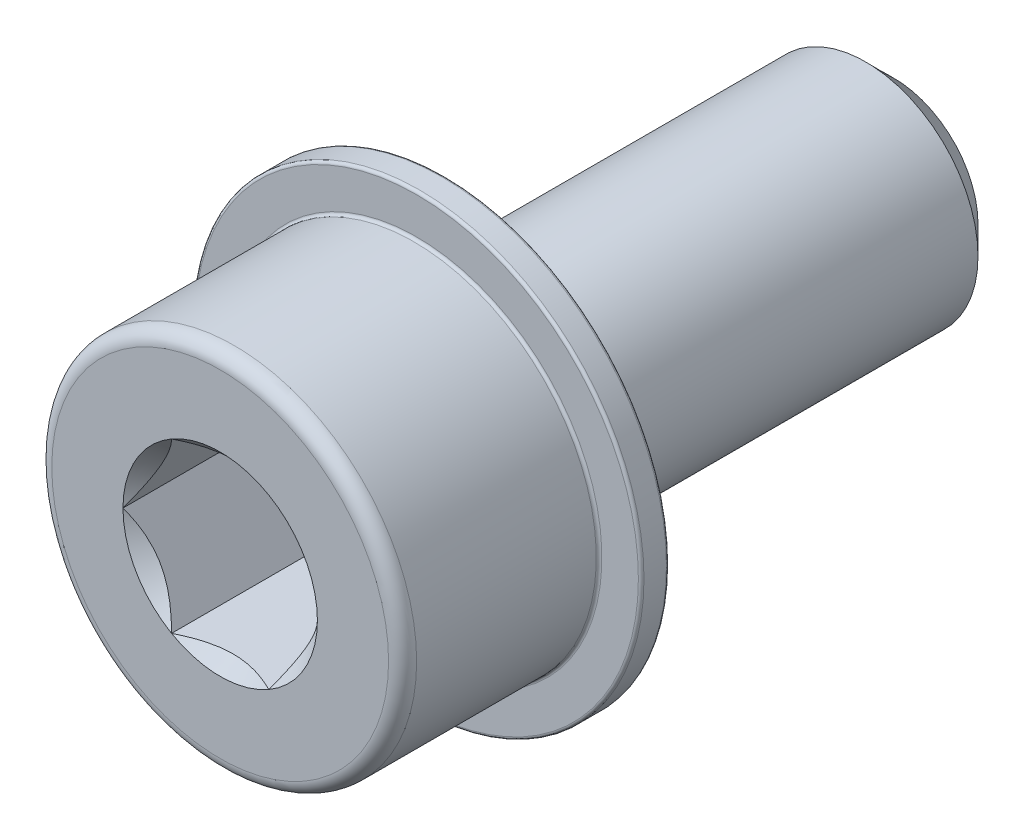
ISO-10303-21;
HEADER;
FILE_DESCRIPTION(('STEP AP214'),'2;1');
FILE_NAME('part.step','',(''),(''),'','','');
FILE_SCHEMA(('AUTOMOTIVE_DESIGN { 1 0 10303 214 1 1 1 1 }'));
ENDSEC;
DATA;
#1=APPLICATION_CONTEXT('core data for automotive mechanical design processes');
#2=APPLICATION_PROTOCOL_DEFINITION('international standard','automotive_design',2000,#1);
#3=PRODUCT_CONTEXT('',#1,'mechanical');
#4=PRODUCT('Part','Part','',(#3));
#5=PRODUCT_RELATED_PRODUCT_CATEGORY('part','',(#4));
#6=PRODUCT_DEFINITION_FORMATION('','',#4);
#7=PRODUCT_DEFINITION_CONTEXT('part definition',#1,'design');
#8=PRODUCT_DEFINITION('design','',#6,#7);
#9=PRODUCT_DEFINITION_SHAPE('','',#8);
#10=(LENGTH_UNIT() NAMED_UNIT(*) SI_UNIT(.MILLI.,.METRE.));
#11=(NAMED_UNIT(*) PLANE_ANGLE_UNIT() SI_UNIT($,.RADIAN.));
#12=(NAMED_UNIT(*) SI_UNIT($,.STERADIAN.) SOLID_ANGLE_UNIT());
#13=UNCERTAINTY_MEASURE_WITH_UNIT(LENGTH_MEASURE(1.E-05),#10,'distance_accuracy_value','');
#14=(GEOMETRIC_REPRESENTATION_CONTEXT(3) GLOBAL_UNCERTAINTY_ASSIGNED_CONTEXT((#13)) GLOBAL_UNIT_ASSIGNED_CONTEXT((#10,
#11,#12)) REPRESENTATION_CONTEXT('',''));
#15=CARTESIAN_POINT('',(0.,0.,0.));
#16=DIRECTION('',(0.,0.,1.));
#17=DIRECTION('',(1.,0.,0.));
#18=AXIS2_PLACEMENT_3D('',#15,#16,#17);
#19=CARTESIAN_POINT('',(0.,0.,24.));
#20=DIRECTION('',(0.,0.,-1.));
#21=DIRECTION('',(-1.,0.,0.));
#22=AXIS2_PLACEMENT_3D('',#19,#20,#21);
#23=CYLINDRICAL_SURFACE('',#22,6.5);
#24=CARTESIAN_POINT('',(0.,0.,17.1));
#25=DIRECTION('',(0.,0.,-1.));
#26=DIRECTION('',(-1.,0.,0.));
#27=AXIS2_PLACEMENT_3D('',#24,#25,#26);
#28=CIRCLE('',#27,6.5);
#29=CARTESIAN_POINT('',(-6.5,0.,17.1));
#30=VERTEX_POINT('',#29);
#31=EDGE_CURVE('E11',#30,#30,#28,.F.);
#32=ORIENTED_EDGE('',*,*,#31,.T.);
#33=EDGE_LOOP('',(#32));
#34=FACE_BOUND('',#33,.T.);
#35=CARTESIAN_POINT('',(0.,0.,23.5));
#36=DIRECTION('',(0.,0.,1.));
#37=DIRECTION('',(1.,0.,0.));
#38=AXIS2_PLACEMENT_3D('',#35,#36,#37);
#39=CIRCLE('',#38,6.5);
#40=CARTESIAN_POINT('',(6.5,0.,23.5));
#41=VERTEX_POINT('',#40);
#42=EDGE_CURVE('E258',#41,#41,#39,.F.);
#43=ORIENTED_EDGE('',*,*,#42,.T.);
#44=EDGE_LOOP('',(#43));
#45=FACE_BOUND('',#44,.T.);
#46=ADVANCED_FACE('F36',(#34,#45),#23,.T.);
#47=CARTESIAN_POINT('',(0.,0.,24.));
#48=DIRECTION('',(0.,0.,1.));
#49=DIRECTION('',(1.,0.,0.));
#50=AXIS2_PLACEMENT_3D('',#47,#48,#49);
#51=PLANE('',#50);
#52=CARTESIAN_POINT('',(0.,0.,24.));
#53=DIRECTION('',(0.,0.,1.));
#54=DIRECTION('',(1.,0.,0.));
#55=AXIS2_PLACEMENT_3D('',#52,#53,#54);
#56=CIRCLE('',#55,6.);
#57=CARTESIAN_POINT('',(6.,0.,24.));
#58=VERTEX_POINT('',#57);
#59=EDGE_CURVE('E109',#58,#58,#56,.T.);
#60=ORIENTED_EDGE('',*,*,#59,.T.);
#61=EDGE_LOOP('',(#60));
#62=FACE_BOUND('',#61,.T.);
#63=CARTESIAN_POINT('',(0.,0.,24.));
#64=DIRECTION('',(0.,0.,1.));
#65=DIRECTION('',(1.,0.,0.));
#66=AXIS2_PLACEMENT_3D('',#63,#64,#65);
#67=CIRCLE('',#66,3.46410161513776);
#68=CARTESIAN_POINT('',(3.46410161513776,0.,24.));
#69=VERTEX_POINT('',#68);
#70=CARTESIAN_POINT('',(1.73205080756888,3.,24.));
#71=VERTEX_POINT('',#70);
#72=EDGE_CURVE('E90',#69,#71,#67,.T.);
#73=ORIENTED_EDGE('',*,*,#72,.F.);
#74=CARTESIAN_POINT('',(1.73205080756888,-3.,24.));
#75=VERTEX_POINT('',#74);
#76=EDGE_CURVE('E50',#75,#69,#67,.T.);
#77=ORIENTED_EDGE('',*,*,#76,.F.);
#78=CARTESIAN_POINT('',(-1.73205080756888,-3.,24.));
#79=VERTEX_POINT('',#78);
#80=EDGE_CURVE('E320',#79,#75,#67,.T.);
#81=ORIENTED_EDGE('',*,*,#80,.F.);
#82=CARTESIAN_POINT('',(-3.46410161513776,0.,24.));
#83=VERTEX_POINT('',#82);
#84=EDGE_CURVE('E57',#83,#79,#67,.T.);
#85=ORIENTED_EDGE('',*,*,#84,.F.);
#86=CARTESIAN_POINT('',(-1.73205080756888,3.,24.));
#87=VERTEX_POINT('',#86);
#88=EDGE_CURVE('E131',#87,#83,#67,.T.);
#89=ORIENTED_EDGE('',*,*,#88,.F.);
#90=EDGE_CURVE('E99',#71,#87,#67,.T.);
#91=ORIENTED_EDGE('',*,*,#90,.F.);
#92=EDGE_LOOP('',(#73,#77,#81,#85,#89,#91));
#93=FACE_BOUND('',#92,.T.);
#94=ADVANCED_FACE('F130',(#62,#93),#51,.T.);
#95=CARTESIAN_POINT('',(0.,0.,24.));
#96=DIRECTION('',(0.,0.,1.));
#97=DIRECTION('',(1.,0.,0.));
#98=AXIS2_PLACEMENT_3D('',#95,#96,#97);
#99=CONICAL_SURFACE('',#98,3.46410161513776,0.785398163397449);
#100=ORIENTED_EDGE('',*,*,#90,.T.);
#101=CARTESIAN_POINT('',(-3.40188153141397,3.,25.071623018675));
#102=CARTESIAN_POINT('',(-3.31880839496225,3.,25.0093307707653));
#103=CARTESIAN_POINT('',(-3.23526432463499,3.,24.9476562262713));
#104=CARTESIAN_POINT('',(-3.06705083944725,3.,24.825817186681));
#105=CARTESIAN_POINT('',(-2.98238114192822,3.,24.7656530822642));
#106=CARTESIAN_POINT('',(-2.81111390830011,3.,24.6466823260063));
#107=CARTESIAN_POINT('',(-2.72450651479474,3.,24.5878898159252));
#108=CARTESIAN_POINT('',(-2.5498128465526,3.,24.4725516902232));
#109=CARTESIAN_POINT('',(-2.46172667795769,3.,24.4160059143113));
#110=CARTESIAN_POINT('',(-2.27892768432208,3.,24.3026064434241));
#111=CARTESIAN_POINT('',(-2.18411772294209,3.,24.2459085325007));
#112=CARTESIAN_POINT('',(-1.99231796342786,3.,24.1363338489189));
#113=CARTESIAN_POINT('',(-1.89532845598629,3.,24.0834565706102));
#114=CARTESIAN_POINT('',(-1.6991502417869,3.,23.9826433846406));
#115=CARTESIAN_POINT('',(-1.59996871640864,3.,23.9346936118117));
#116=CARTESIAN_POINT('',(-1.39893527870468,3.,23.8448170133997));
#117=CARTESIAN_POINT('',(-1.29708458210817,3.,23.8028875002659));
#118=CARTESIAN_POINT('',(-1.0982186531427,3.,23.7293601977538));
#119=CARTESIAN_POINT('',(-1.00140329048655,3.,23.6972274830937));
#120=CARTESIAN_POINT('',(-0.805487586800686,3.,23.6407367466802));
#121=CARTESIAN_POINT('',(-0.706387084473375,3.,23.6163792755582));
#122=CARTESIAN_POINT('',(-0.508116211624926,3.,23.5771014895869));
#123=CARTESIAN_POINT('',(-0.408977763183684,3.,23.5620226377466));
#124=CARTESIAN_POINT('',(-0.209698791301063,3.,23.5415865192691));
#125=CARTESIAN_POINT('',(-0.109558431989066,3.,23.5362276857281));
#126=CARTESIAN_POINT('',(0.0873520516843387,3.,23.535609235846));
#127=CARTESIAN_POINT('',(0.184121252918254,3.,23.5400131533177));
#128=CARTESIAN_POINT('',(0.376804854524576,3.,23.557946416793));
#129=CARTESIAN_POINT('',(0.472719169351943,3.,23.5714766658715));
#130=CARTESIAN_POINT('',(0.66461966332242,3.,23.6071635369876));
#131=CARTESIAN_POINT('',(0.760578448954833,3.,23.6294651712297));
#132=CARTESIAN_POINT('',(0.950411386335508,3.,23.6815211461887));
#133=CARTESIAN_POINT('',(1.04428572934496,3.,23.7112748000321));
#134=CARTESIAN_POINT('',(1.23968230612517,3.,23.7805237867733));
#135=CARTESIAN_POINT('',(1.34095401081408,3.,23.8207192131534));
#136=CARTESIAN_POINT('',(1.54084264319093,3.,23.9072590407946));
#137=CARTESIAN_POINT('',(1.63945865301323,3.,23.9536055360041));
#138=CARTESIAN_POINT('',(1.8345457021536,3.,24.0513511324151));
#139=CARTESIAN_POINT('',(1.93100848905254,3.,24.1027665721575));
#140=CARTESIAN_POINT('',(2.12170828880386,3.,24.2095076183011));
#141=CARTESIAN_POINT('',(2.21594570238894,3.,24.2648325134343));
#142=CARTESIAN_POINT('',(2.39783630702513,3.,24.3757799204079));
#143=CARTESIAN_POINT('',(2.48558325753569,3.,24.4312495308021));
#144=CARTESIAN_POINT('',(2.65957133871347,3.,24.5445092718899));
#145=CARTESIAN_POINT('',(2.74581235420106,3.,24.6022995789736));
#146=CARTESIAN_POINT('',(2.91628413803161,3.,24.7193054641893));
#147=CARTESIAN_POINT('',(3.00052556721126,3.,24.7785055655618));
#148=CARTESIAN_POINT('',(3.16785911169907,3.,24.8984622960702));
#149=CARTESIAN_POINT('',(3.25095153629611,3.,24.9592184932626));
#150=CARTESIAN_POINT('',(3.33356317170769,3.,25.0206105740407));
#151=B_SPLINE_CURVE_WITH_KNOTS('',3,(#101,#102,#103,#104,#105,#106,#107,#108,#109,#110,#111,
#112,#113,#114,#115,#116,#117,#118,#119,#120,#121,#122,#123,#124,#125,#126,#127,#128,#129,#130,
#131,#132,#133,#134,#135,#136,#137,#138,#139,#140,#141,#142,#143,#144,#145,#146,#147,#148,#149,
#150),.UNSPECIFIED.,.F.,.F.,(4,2,2,2,2,2,2,2,2,2,2,2,2,2,2,2,2,2,2,2,2,2,2,2,4),(0.,
0.31150788964413,0.623095538398644,0.937099065704867,1.25108015037407,1.58241857439006,
1.91371306604159,2.24404824101607,2.57423548692227,2.87999017792551,3.18576651722764,
3.486161620239,3.78650829411698,4.07666515932723,4.36685074054528,4.6620503227987,
4.95722270569223,5.28383771583299,5.61056419890145,5.93838056110907,6.26613743475899,
6.57752286720456,6.88893201218749,7.19780024979462,7.50658366111556),.UNSPECIFIED.);
#152=EDGE_CURVE('E104',#71,#87,#151,.F.);
#153=ORIENTED_EDGE('',*,*,#152,.F.);
#154=EDGE_LOOP('',(#100,#153));
#155=FACE_BOUND('',#154,.T.);
#156=ADVANCED_FACE('F105',(#155),#99,.F.);
#157=ORIENTED_EDGE('',*,*,#88,.T.);
#158=CARTESIAN_POINT('',(-1.73193533751504,3.0002,24.0001154758271));
#159=CARTESIAN_POINT('',(-1.79147372663452,2.89707648504425,23.9406283183218));
#160=CARTESIAN_POINT('',(-1.85200767512883,2.79222861066935,23.8846349794655));
#161=CARTESIAN_POINT('',(-1.97544301635334,2.5784323282189,23.7821125963789));
#162=CARTESIAN_POINT('',(-2.03835614749388,2.46946358862024,23.7356405937413));
#163=CARTESIAN_POINT('',(-2.16521745390422,2.24973336040297,23.6560331885163));
#164=CARTESIAN_POINT('',(-2.22913332270057,2.13902782823779,23.6226977006427));
#165=CARTESIAN_POINT('',(-2.35837216363117,1.91517958943467,23.5713375439793));
#166=CARTESIAN_POINT('',(-2.42369118784644,1.802043720793,23.5532745375356));
#167=CARTESIAN_POINT('',(-2.53626564359199,1.60705904380729,23.5369769084505));
#168=CARTESIAN_POINT('',(-2.58337569224233,1.52546204599786,23.5345643671738));
#169=CARTESIAN_POINT('',(-2.67751916315865,1.36240077116991,23.5386294346571));
#170=CARTESIAN_POINT('',(-2.7245525527757,1.28093655070101,23.5451101600283));
#171=CARTESIAN_POINT('',(-2.81817374583237,1.11877988766163,23.5665917225152));
#172=CARTESIAN_POINT('',(-2.86476099147974,1.03808841121569,23.5816020899673));
#173=CARTESIAN_POINT('',(-2.95713536549225,0.878091302108662,23.619323646066));
#174=CARTESIAN_POINT('',(-3.00292255491614,0.798785563690701,23.6420342443228));
#175=CARTESIAN_POINT('',(-3.0842086834051,0.657993859197245,23.6887606848539));
#176=CARTESIAN_POINT('',(-3.11988753362891,0.596196277853973,23.7115483276808));
#177=CARTESIAN_POINT('',(-3.19060468282508,0.473710582479779,23.7607962860574));
#178=CARTESIAN_POINT('',(-3.2256429622163,0.413022502364395,23.7872567136662));
#179=CARTESIAN_POINT('',(-3.29496858432308,0.292947002609136,23.8432569943914));
#180=CARTESIAN_POINT('',(-3.32925789884291,0.233556167704082,23.8727871644784));
#181=CARTESIAN_POINT('',(-3.39720147685868,0.115874438532731,23.9345390915755));
#182=CARTESIAN_POINT('',(-3.43085611477446,0.0575828957522661,23.9667591966594));
#183=CARTESIAN_POINT('',(-3.46421708519159,-0.000200000000000237,24.0001154758271));
#184=B_SPLINE_CURVE_WITH_KNOTS('',3,(#158,#159,#160,#161,#162,#163,#164,#165,#166,#167,#168,
#169,#170,#171,#172,#173,#174,#175,#176,#177,#178,#179,#180,#181,#182,#183),.UNSPECIFIED.,.F.,
.F.,(4,2,2,2,2,2,2,2,2,2,2,2,4),(0.,0.399603557139308,0.801535286397847,1.19708369162343,
1.59163620080173,1.87398941755845,2.15644160919093,2.43921001247426,2.72195674032138,
2.94657516661927,3.17120044767274,3.3951375283781,3.61893808380739),.UNSPECIFIED.);
#185=EDGE_CURVE('E98',#87,#83,#184,.T.);
#186=ORIENTED_EDGE('',*,*,#185,.F.);
#187=EDGE_LOOP('',(#157,#186));
#188=FACE_BOUND('',#187,.T.);
#189=ADVANCED_FACE('F326',(#188),#99,.F.);
#190=ORIENTED_EDGE('',*,*,#84,.T.);
#191=CARTESIAN_POINT('',(-3.46421708519159,0.000199999999999766,24.0001154758271));
#192=CARTESIAN_POINT('',(-3.40467869607211,-0.102923514955749,23.9406283183218));
#193=CARTESIAN_POINT('',(-3.3441447475778,-0.207771389330651,23.8846349794655));
#194=CARTESIAN_POINT('',(-3.22070940635329,-0.421567671781097,23.7821125963789));
#195=CARTESIAN_POINT('',(-3.15779627521275,-0.53053641137976,23.7356405937413));
#196=CARTESIAN_POINT('',(-3.03093496880241,-0.750266639597028,23.6560331885163));
#197=CARTESIAN_POINT('',(-2.96701910000606,-0.860972171762211,23.6226977006427));
#198=CARTESIAN_POINT('',(-2.83778025907546,-1.08482041056532,23.5713375439793));
#199=CARTESIAN_POINT('',(-2.77246123486019,-1.19795627920699,23.5532745375356));
#200=CARTESIAN_POINT('',(-2.65988677911464,-1.3929409561927,23.5369769084505));
#201=CARTESIAN_POINT('',(-2.6127767304643,-1.47453795400213,23.5345643671738));
#202=CARTESIAN_POINT('',(-2.51863325954798,-1.63759922883009,23.5386294346571));
#203=CARTESIAN_POINT('',(-2.47159986993094,-1.71906344929899,23.5451101600283));
#204=CARTESIAN_POINT('',(-2.37797867687426,-1.88122011233837,23.5665917225152));
#205=CARTESIAN_POINT('',(-2.33139143122689,-1.9619115887843,23.5816020899673));
#206=CARTESIAN_POINT('',(-2.23901705721438,-2.12190869789133,23.619323646066));
#207=CARTESIAN_POINT('',(-2.19322986779049,-2.20121443630929,23.6420342443228));
#208=CARTESIAN_POINT('',(-2.11194373930153,-2.34200614080275,23.6887606848539));
#209=CARTESIAN_POINT('',(-2.07626488907772,-2.40380372214602,23.7115483276808));
#210=CARTESIAN_POINT('',(-2.00554773988155,-2.52628941752022,23.7607962860574));
#211=CARTESIAN_POINT('',(-1.97050946049033,-2.5869774976356,23.7872567136662));
#212=CARTESIAN_POINT('',(-1.90118383838356,-2.70705299739086,23.8432569943914));
#213=CARTESIAN_POINT('',(-1.86689452386373,-2.76644383229592,23.8727871644784));
#214=CARTESIAN_POINT('',(-1.79895094584795,-2.88412556146727,23.9345390915755));
#215=CARTESIAN_POINT('',(-1.76529630793216,-2.94241710424773,23.9667591966594));
#216=CARTESIAN_POINT('',(-1.73193533751504,-3.0002,24.0001154758271));
#217=B_SPLINE_CURVE_WITH_KNOTS('',3,(#191,#192,#193,#194,#195,#196,#197,#198,#199,#200,#201,
#202,#203,#204,#205,#206,#207,#208,#209,#210,#211,#212,#213,#214,#215,#216),.UNSPECIFIED.,.F.,
.F.,(4,2,2,2,2,2,2,2,2,2,2,2,4),(0.,0.399603557139307,0.801535286397845,1.19708369162343,
1.59163620080173,1.87398941755844,2.15644160919092,2.43921001247425,2.72195674032138,
2.94657516661926,3.17120044767274,3.3951375283781,3.61893808380739),.UNSPECIFIED.);
#218=EDGE_CURVE('E141',#83,#79,#217,.T.);
#219=ORIENTED_EDGE('',*,*,#218,.F.);
#220=EDGE_LOOP('',(#190,#219));
#221=FACE_BOUND('',#220,.T.);
#222=ADVANCED_FACE('F328',(#221),#99,.F.);
#223=ORIENTED_EDGE('',*,*,#80,.T.);
#224=CARTESIAN_POINT('',(-3.40188153141397,-3.,25.071623018675));
#225=CARTESIAN_POINT('',(-3.31880839496224,-3.,25.0093307707653));
#226=CARTESIAN_POINT('',(-3.23526432463498,-3.,24.9476562262713));
#227=CARTESIAN_POINT('',(-3.06705083944724,-3.,24.825817186681));
#228=CARTESIAN_POINT('',(-2.98238114192821,-3.,24.7656530822642));
#229=CARTESIAN_POINT('',(-2.81111390830011,-3.,24.6466823260063));
#230=CARTESIAN_POINT('',(-2.72450651479473,-3.,24.5878898159252));
#231=CARTESIAN_POINT('',(-2.54981284655259,-3.,24.4725516902232));
#232=CARTESIAN_POINT('',(-2.46172667795768,-3.,24.4160059143113));
#233=CARTESIAN_POINT('',(-2.27892768432207,-3.,24.3026064434241));
#234=CARTESIAN_POINT('',(-2.18411772294209,-3.,24.2459085325007));
#235=CARTESIAN_POINT('',(-1.99231796342786,-3.,24.1363338489189));
#236=CARTESIAN_POINT('',(-1.89532845598629,-3.,24.0834565706102));
#237=CARTESIAN_POINT('',(-1.69915024178689,-3.,23.9826433846406));
#238=CARTESIAN_POINT('',(-1.59996871640864,-3.,23.9346936118117));
#239=CARTESIAN_POINT('',(-1.39893527870468,-3.,23.8448170133997));
#240=CARTESIAN_POINT('',(-1.29708458210817,-3.,23.8028875002659));
#241=CARTESIAN_POINT('',(-1.0982186531427,-3.,23.7293601977538));
#242=CARTESIAN_POINT('',(-1.00140329048654,-3.,23.6972274830937));
#243=CARTESIAN_POINT('',(-0.805487586800684,-3.,23.6407367466802));
#244=CARTESIAN_POINT('',(-0.706387084473374,-3.,23.6163792755582));
#245=CARTESIAN_POINT('',(-0.508116211624925,-3.,23.5771014895869));
#246=CARTESIAN_POINT('',(-0.408977763183682,-3.,23.5620226377466));
#247=CARTESIAN_POINT('',(-0.20969879130106,-3.,23.5415865192691));
#248=CARTESIAN_POINT('',(-0.109558431989063,-3.,23.5362276857281));
#249=CARTESIAN_POINT('',(0.0873520516843421,-3.,23.535609235846));
#250=CARTESIAN_POINT('',(0.184121252918257,-3.,23.5400131533177));
#251=CARTESIAN_POINT('',(0.376804854524579,-3.,23.557946416793));
#252=CARTESIAN_POINT('',(0.472719169351945,-3.,23.5714766658715));
#253=CARTESIAN_POINT('',(0.664619663322421,-3.,23.6071635369876));
#254=CARTESIAN_POINT('',(0.760578448954833,-3.,23.6294651712297));
#255=CARTESIAN_POINT('',(0.950411386335509,-3.,23.6815211461887));
#256=CARTESIAN_POINT('',(1.04428572934496,-3.,23.7112748000321));
#257=CARTESIAN_POINT('',(1.23968230612517,-3.,23.7805237867733));
#258=CARTESIAN_POINT('',(1.34095401081408,-3.,23.8207192131534));
#259=CARTESIAN_POINT('',(1.54084264319093,-3.,23.9072590407946));
#260=CARTESIAN_POINT('',(1.63945865301323,-3.,23.9536055360041));
#261=CARTESIAN_POINT('',(1.8345457021536,-3.,24.0513511324151));
#262=CARTESIAN_POINT('',(1.93100848905254,-3.,24.1027665721575));
#263=CARTESIAN_POINT('',(2.12170828880386,-3.,24.2095076183011));
#264=CARTESIAN_POINT('',(2.21594570238895,-3.,24.2648325134343));
#265=CARTESIAN_POINT('',(2.39783630702514,-3.,24.3757799204079));
#266=CARTESIAN_POINT('',(2.48558325753569,-3.,24.4312495308021));
#267=CARTESIAN_POINT('',(2.65957133871347,-3.,24.5445092718899));
#268=CARTESIAN_POINT('',(2.74581235420107,-3.,24.6022995789736));
#269=CARTESIAN_POINT('',(2.91628413803161,-3.,24.7193054641893));
#270=CARTESIAN_POINT('',(3.00052556721127,-3.,24.7785055655618));
#271=CARTESIAN_POINT('',(3.16785911169908,-3.,24.8984622960703));
#272=CARTESIAN_POINT('',(3.25095153629611,-3.,24.9592184932626));
#273=CARTESIAN_POINT('',(3.3335631717077,-3.,25.0206105740407));
#274=B_SPLINE_CURVE_WITH_KNOTS('',3,(#224,#225,#226,#227,#228,#229,#230,#231,#232,#233,#234,
#235,#236,#237,#238,#239,#240,#241,#242,#243,#244,#245,#246,#247,#248,#249,#250,#251,#252,#253,
#254,#255,#256,#257,#258,#259,#260,#261,#262,#263,#264,#265,#266,#267,#268,#269,#270,#271,#272,
#273),.UNSPECIFIED.,.F.,.F.,(4,2,2,2,2,2,2,2,2,2,2,2,2,2,2,2,2,2,2,2,2,2,2,2,4),(0.,
0.311507889644128,0.623095538398643,0.937099065704863,1.25108015037407,1.58241857439006,
1.91371306604158,2.24404824101606,2.57423548692226,2.8799901779255,3.18576651722763,
3.486161620239,3.78650829411697,4.07666515932722,4.36685074054527,4.66205032279869,
4.95722270569223,5.28383771583299,5.61056419890145,5.93838056110906,6.26613743475899,
6.57752286720455,6.88893201218749,7.19780024979462,7.50658366111556),.UNSPECIFIED.);
#275=EDGE_CURVE('E171',#79,#75,#274,.T.);
#276=ORIENTED_EDGE('',*,*,#275,.F.);
#277=EDGE_LOOP('',(#223,#276));
#278=FACE_BOUND('',#277,.T.);
#279=ADVANCED_FACE('F321',(#278),#99,.F.);
#280=ORIENTED_EDGE('',*,*,#76,.T.);
#281=CARTESIAN_POINT('',(1.73193533751504,-3.0002,24.0001154758272));
#282=CARTESIAN_POINT('',(1.79147372663452,-2.89707648504425,23.9406283183218));
#283=CARTESIAN_POINT('',(1.85200767512883,-2.79222861066935,23.8846349794655));
#284=CARTESIAN_POINT('',(1.97544301635334,-2.57843232821891,23.7821125963789));
#285=CARTESIAN_POINT('',(2.03835614749388,-2.46946358862024,23.7356405937413));
#286=CARTESIAN_POINT('',(2.16521745390422,-2.24973336040297,23.6560331885163));
#287=CARTESIAN_POINT('',(2.22913332270057,-2.13902782823779,23.6226977006427));
#288=CARTESIAN_POINT('',(2.35837216363117,-1.91517958943468,23.5713375439793));
#289=CARTESIAN_POINT('',(2.42369118784644,-1.80204372079301,23.5532745375356));
#290=CARTESIAN_POINT('',(2.53626564359199,-1.6070590438073,23.5369769084505));
#291=CARTESIAN_POINT('',(2.58337569224233,-1.52546204599787,23.5345643671738));
#292=CARTESIAN_POINT('',(2.67751916315865,-1.36240077116991,23.5386294346571));
#293=CARTESIAN_POINT('',(2.7245525527757,-1.28093655070101,23.5451101600283));
#294=CARTESIAN_POINT('',(2.81817374583237,-1.11877988766163,23.5665917225152));
#295=CARTESIAN_POINT('',(2.86476099147974,-1.0380884112157,23.5816020899673));
#296=CARTESIAN_POINT('',(2.95713536549225,-0.878091302108666,23.619323646066));
#297=CARTESIAN_POINT('',(3.00292255491614,-0.798785563690705,23.6420342443228));
#298=CARTESIAN_POINT('',(3.0842086834051,-0.657993859197248,23.6887606848539));
#299=CARTESIAN_POINT('',(3.11988753362891,-0.596196277853976,23.7115483276808));
#300=CARTESIAN_POINT('',(3.19060468282508,-0.473710582479783,23.7607962860574));
#301=CARTESIAN_POINT('',(3.2256429622163,-0.413022502364399,23.7872567136662));
#302=CARTESIAN_POINT('',(3.29496858432308,-0.292947002609139,23.8432569943914));
#303=CARTESIAN_POINT('',(3.32925789884291,-0.233556167704083,23.8727871644784));
#304=CARTESIAN_POINT('',(3.39720147685869,-0.115874438532732,23.9345390915755));
#305=CARTESIAN_POINT('',(3.43085611477447,-0.0575828957522665,23.9667591966594));
#306=CARTESIAN_POINT('',(3.46421708519159,0.000199999999999132,24.0001154758271));
#307=B_SPLINE_CURVE_WITH_KNOTS('',3,(#281,#282,#283,#284,#285,#286,#287,#288,#289,#290,#291,
#292,#293,#294,#295,#296,#297,#298,#299,#300,#301,#302,#303,#304,#305,#306),.UNSPECIFIED.,.F.,
.F.,(4,2,2,2,2,2,2,2,2,2,2,2,4),(0.,0.399603557139308,0.801535286397848,1.19708369162343,
1.59163620080173,1.87398941755845,2.15644160919093,2.43921001247425,2.72195674032138,
2.94657516661927,3.17120044767274,3.3951375283781,3.61893808380739),.UNSPECIFIED.);
#308=EDGE_CURVE('E120',#75,#69,#307,.T.);
#309=ORIENTED_EDGE('',*,*,#308,.F.);
#310=EDGE_LOOP('',(#280,#309));
#311=FACE_BOUND('',#310,.T.);
#312=ADVANCED_FACE('F156',(#311),#99,.F.);
#313=ORIENTED_EDGE('',*,*,#72,.T.);
#314=CARTESIAN_POINT('',(3.46421708519159,-0.000199999999999999,24.0001154758272));
#315=CARTESIAN_POINT('',(3.40467869607211,0.102923514955748,23.9406283183218));
#316=CARTESIAN_POINT('',(3.3441447475778,0.20777138933065,23.8846349794655));
#317=CARTESIAN_POINT('',(3.2207094063533,0.421567671781096,23.7821125963789));
#318=CARTESIAN_POINT('',(3.15779627521275,0.530536411379761,23.7356405937413));
#319=CARTESIAN_POINT('',(3.03093496880241,0.75026663959703,23.6560331885163));
#320=CARTESIAN_POINT('',(2.96701910000607,0.860972171762214,23.6226977006427));
#321=CARTESIAN_POINT('',(2.83778025907546,1.08482041056533,23.5713375439793));
#322=CARTESIAN_POINT('',(2.77246123486019,1.197956279207,23.5532745375356));
#323=CARTESIAN_POINT('',(2.65988677911464,1.3929409561927,23.5369769084505));
#324=CARTESIAN_POINT('',(2.6127767304643,1.47453795400214,23.5345643671738));
#325=CARTESIAN_POINT('',(2.51863325954798,1.63759922883009,23.5386294346571));
#326=CARTESIAN_POINT('',(2.47159986993094,1.71906344929899,23.5451101600283));
#327=CARTESIAN_POINT('',(2.37797867687426,1.88122011233837,23.5665917225152));
#328=CARTESIAN_POINT('',(2.33139143122689,1.9619115887843,23.5816020899673));
#329=CARTESIAN_POINT('',(2.23901705721438,2.12190869789134,23.619323646066));
#330=CARTESIAN_POINT('',(2.19322986779049,2.2012144363093,23.6420342443228));
#331=CARTESIAN_POINT('',(2.11194373930153,2.34200614080275,23.6887606848539));
#332=CARTESIAN_POINT('',(2.07626488907772,2.40380372214603,23.7115483276808));
#333=CARTESIAN_POINT('',(2.00554773988155,2.52628941752022,23.7607962860574));
#334=CARTESIAN_POINT('',(1.97050946049034,2.5869774976356,23.7872567136662));
#335=CARTESIAN_POINT('',(1.90118383838356,2.70705299739086,23.8432569943914));
#336=CARTESIAN_POINT('',(1.86689452386373,2.76644383229592,23.8727871644784));
#337=CARTESIAN_POINT('',(1.79895094584795,2.88412556146727,23.9345390915755));
#338=CARTESIAN_POINT('',(1.76529630793217,2.94241710424774,23.9667591966594));
#339=CARTESIAN_POINT('',(1.73193533751504,3.0002,24.0001154758271));
#340=B_SPLINE_CURVE_WITH_KNOTS('',3,(#314,#315,#316,#317,#318,#319,#320,#321,#322,#323,#324,
#325,#326,#327,#328,#329,#330,#331,#332,#333,#334,#335,#336,#337,#338,#339),.UNSPECIFIED.,.F.,
.F.,(4,2,2,2,2,2,2,2,2,2,2,2,4),(0.,0.399603557139308,0.801535286397848,1.19708369162343,
1.59163620080173,1.87398941755845,2.15644160919093,2.43921001247425,2.72195674032138,
2.94657516661927,3.17120044767274,3.3951375283781,3.61893808380739),.UNSPECIFIED.);
#341=EDGE_CURVE('E94',#69,#71,#340,.T.);
#342=ORIENTED_EDGE('',*,*,#341,.F.);
#343=EDGE_LOOP('',(#313,#342));
#344=FACE_BOUND('',#343,.T.);
#345=ADVANCED_FACE('F92',(#344),#99,.F.);
#346=CARTESIAN_POINT('',(0.,0.,18.));
#347=DIRECTION('',(0.,0.,1.));
#348=DIRECTION('',(1.,0.,0.));
#349=AXIS2_PLACEMENT_3D('',#346,#347,#348);
#350=PLANE('',#349);
#351=DIRECTION('',(-0.5,0.866025403784439,0.));
#352=VECTOR('',#351,1.);
#353=CARTESIAN_POINT('',(3.46410161513776,0.,18.));
#354=LINE('',#353,#352);
#355=CARTESIAN_POINT('',(3.46410161513776,0.,18.));
#356=VERTEX_POINT('',#355);
#357=CARTESIAN_POINT('',(1.73205080756888,3.,18.));
#358=VERTEX_POINT('',#357);
#359=EDGE_CURVE('E119',#356,#358,#354,.T.);
#360=ORIENTED_EDGE('',*,*,#359,.T.);
#361=DIRECTION('',(-1.,0.,0.));
#362=VECTOR('',#361,1.);
#363=CARTESIAN_POINT('',(1.73205080756888,3.,18.));
#364=LINE('',#363,#362);
#365=CARTESIAN_POINT('',(-1.73205080756888,3.,18.));
#366=VERTEX_POINT('',#365);
#367=EDGE_CURVE('E124',#358,#366,#364,.T.);
#368=ORIENTED_EDGE('',*,*,#367,.T.);
#369=DIRECTION('',(-0.5,-0.866025403784439,0.));
#370=VECTOR('',#369,1.);
#371=CARTESIAN_POINT('',(-1.73205080756888,3.,18.));
#372=LINE('',#371,#370);
#373=CARTESIAN_POINT('',(-3.46410161513775,0.,18.));
#374=VERTEX_POINT('',#373);
#375=EDGE_CURVE('E310',#366,#374,#372,.T.);
#376=ORIENTED_EDGE('',*,*,#375,.T.);
#377=DIRECTION('',(0.5,-0.866025403784439,0.));
#378=VECTOR('',#377,1.);
#379=CARTESIAN_POINT('',(-3.46410161513775,0.,18.));
#380=LINE('',#379,#378);
#381=CARTESIAN_POINT('',(-1.73205080756887,-3.,18.));
#382=VERTEX_POINT('',#381);
#383=EDGE_CURVE('E307',#374,#382,#380,.T.);
#384=ORIENTED_EDGE('',*,*,#383,.T.);
#385=DIRECTION('',(1.,0.,0.));
#386=VECTOR('',#385,1.);
#387=CARTESIAN_POINT('',(-1.73205080756887,-3.,18.));
#388=LINE('',#387,#386);
#389=CARTESIAN_POINT('',(1.73205080756888,-3.,18.));
#390=VERTEX_POINT('',#389);
#391=EDGE_CURVE('E304',#382,#390,#388,.T.);
#392=ORIENTED_EDGE('',*,*,#391,.T.);
#393=DIRECTION('',(0.5,0.866025403784439,0.));
#394=VECTOR('',#393,1.);
#395=CARTESIAN_POINT('',(1.73205080756888,-3.,18.));
#396=LINE('',#395,#394);
#397=EDGE_CURVE('E127',#390,#356,#396,.T.);
#398=ORIENTED_EDGE('',*,*,#397,.T.);
#399=EDGE_LOOP('',(#360,#368,#376,#384,#392,#398));
#400=FACE_BOUND('',#399,.T.);
#401=ADVANCED_FACE('F155',(#400),#350,.T.);
#402=CARTESIAN_POINT('',(1.73205080756888,3.,18.));
#403=DIRECTION('',(0.,1.,0.));
#404=DIRECTION('',(-1.,0.,0.));
#405=AXIS2_PLACEMENT_3D('',#402,#403,#404);
#406=PLANE('',#405);
#407=DIRECTION('',(0.,0.,1.));
#408=VECTOR('',#407,1.);
#409=CARTESIAN_POINT('',(1.73205080756888,3.,18.));
#410=LINE('',#409,#408);
#411=EDGE_CURVE('E116',#358,#71,#410,.T.);
#412=ORIENTED_EDGE('',*,*,#411,.T.);
#413=ORIENTED_EDGE('',*,*,#152,.T.);
#414=DIRECTION('',(0.,0.,1.));
#415=VECTOR('',#414,1.);
#416=CARTESIAN_POINT('',(-1.73205080756888,3.,18.));
#417=LINE('',#416,#415);
#418=EDGE_CURVE('E126',#366,#87,#417,.T.);
#419=ORIENTED_EDGE('',*,*,#418,.F.);
#420=ORIENTED_EDGE('',*,*,#367,.F.);
#421=EDGE_LOOP('',(#412,#413,#419,#420));
#422=FACE_BOUND('',#421,.T.);
#423=ADVANCED_FACE('F122',(#422),#406,.F.);
#424=CARTESIAN_POINT('',(-1.73205080756888,3.,18.));
#425=DIRECTION('',(-0.866025403784439,0.5,0.));
#426=DIRECTION('',(-0.5,-0.866025403784439,0.));
#427=AXIS2_PLACEMENT_3D('',#424,#425,#426);
#428=PLANE('',#427);
#429=ORIENTED_EDGE('',*,*,#418,.T.);
#430=ORIENTED_EDGE('',*,*,#185,.T.);
#431=DIRECTION('',(0.,0.,1.));
#432=VECTOR('',#431,1.);
#433=CARTESIAN_POINT('',(-3.46410161513775,0.,18.));
#434=LINE('',#433,#432);
#435=EDGE_CURVE('E296',#374,#83,#434,.T.);
#436=ORIENTED_EDGE('',*,*,#435,.F.);
#437=ORIENTED_EDGE('',*,*,#375,.F.);
#438=EDGE_LOOP('',(#429,#430,#436,#437));
#439=FACE_BOUND('',#438,.T.);
#440=ADVANCED_FACE('F148',(#439),#428,.F.);
#441=CARTESIAN_POINT('',(-3.46410161513775,0.,18.));
#442=DIRECTION('',(-0.866025403784439,-0.5,0.));
#443=DIRECTION('',(0.5,-0.866025403784439,0.));
#444=AXIS2_PLACEMENT_3D('',#441,#442,#443);
#445=PLANE('',#444);
#446=ORIENTED_EDGE('',*,*,#435,.T.);
#447=ORIENTED_EDGE('',*,*,#218,.T.);
#448=DIRECTION('',(0.,0.,1.));
#449=VECTOR('',#448,1.);
#450=CARTESIAN_POINT('',(-1.73205080756887,-3.,18.));
#451=LINE('',#450,#449);
#452=EDGE_CURVE('E298',#382,#79,#451,.T.);
#453=ORIENTED_EDGE('',*,*,#452,.F.);
#454=ORIENTED_EDGE('',*,*,#383,.F.);
#455=EDGE_LOOP('',(#446,#447,#453,#454));
#456=FACE_BOUND('',#455,.T.);
#457=ADVANCED_FACE('F195',(#456),#445,.F.);
#458=CARTESIAN_POINT('',(-1.73205080756887,-3.,18.));
#459=DIRECTION('',(0.,-1.,0.));
#460=DIRECTION('',(1.,0.,0.));
#461=AXIS2_PLACEMENT_3D('',#458,#459,#460);
#462=PLANE('',#461);
#463=ORIENTED_EDGE('',*,*,#452,.T.);
#464=ORIENTED_EDGE('',*,*,#275,.T.);
#465=DIRECTION('',(0.,0.,1.));
#466=VECTOR('',#465,1.);
#467=CARTESIAN_POINT('',(1.73205080756888,-3.,18.));
#468=LINE('',#467,#466);
#469=EDGE_CURVE('E288',#390,#75,#468,.T.);
#470=ORIENTED_EDGE('',*,*,#469,.F.);
#471=ORIENTED_EDGE('',*,*,#391,.F.);
#472=EDGE_LOOP('',(#463,#464,#470,#471));
#473=FACE_BOUND('',#472,.T.);
#474=ADVANCED_FACE('F191',(#473),#462,.F.);
#475=CARTESIAN_POINT('',(1.73205080756888,-3.,18.));
#476=DIRECTION('',(0.866025403784439,-0.5,0.));
#477=DIRECTION('',(0.5,0.866025403784439,0.));
#478=AXIS2_PLACEMENT_3D('',#475,#476,#477);
#479=PLANE('',#478);
#480=ORIENTED_EDGE('',*,*,#469,.T.);
#481=ORIENTED_EDGE('',*,*,#308,.T.);
#482=DIRECTION('',(0.,0.,1.));
#483=VECTOR('',#482,1.);
#484=CARTESIAN_POINT('',(3.46410161513776,0.,18.));
#485=LINE('',#484,#483);
#486=EDGE_CURVE('E118',#356,#69,#485,.T.);
#487=ORIENTED_EDGE('',*,*,#486,.F.);
#488=ORIENTED_EDGE('',*,*,#397,.F.);
#489=EDGE_LOOP('',(#480,#481,#487,#488));
#490=FACE_BOUND('',#489,.T.);
#491=ADVANCED_FACE('F188',(#490),#479,.F.);
#492=CARTESIAN_POINT('',(3.46410161513776,0.,18.));
#493=DIRECTION('',(0.866025403784438,0.5,0.));
#494=DIRECTION('',(-0.5,0.866025403784439,0.));
#495=AXIS2_PLACEMENT_3D('',#492,#493,#494);
#496=PLANE('',#495);
#497=ORIENTED_EDGE('',*,*,#486,.T.);
#498=ORIENTED_EDGE('',*,*,#341,.T.);
#499=ORIENTED_EDGE('',*,*,#411,.F.);
#500=ORIENTED_EDGE('',*,*,#359,.F.);
#501=EDGE_LOOP('',(#497,#498,#499,#500));
#502=FACE_BOUND('',#501,.T.);
#503=ADVANCED_FACE('F114',(#502),#496,.F.);
#504=CARTESIAN_POINT('',(0.,0.,23.5));
#505=DIRECTION('',(0.,0.,1.));
#506=DIRECTION('',(1.,0.,0.));
#507=AXIS2_PLACEMENT_3D('',#504,#505,#506);
#508=TOROIDAL_SURFACE('',#507,6.,0.5);
#509=ORIENTED_EDGE('',*,*,#42,.F.);
#510=EDGE_LOOP('',(#509));
#511=FACE_BOUND('',#510,.T.);
#512=ORIENTED_EDGE('',*,*,#59,.F.);
#513=EDGE_LOOP('',(#512));
#514=FACE_BOUND('',#513,.T.);
#515=ADVANCED_FACE('F230',(#511,#514),#508,.T.);
#516=CARTESIAN_POINT('',(0.,0.,17.));
#517=DIRECTION('',(0.,0.,-1.));
#518=DIRECTION('',(-1.,0.,0.));
#519=AXIS2_PLACEMENT_3D('',#516,#517,#518);
#520=CYLINDRICAL_SURFACE('',#519,8.);
#521=CARTESIAN_POINT('',(0.,0.,16.1));
#522=DIRECTION('',(0.,0.,1.));
#523=DIRECTION('',(1.,0.,0.));
#524=AXIS2_PLACEMENT_3D('',#521,#522,#523);
#525=CIRCLE('',#524,8.);
#526=CARTESIAN_POINT('',(8.,0.,16.1));
#527=VERTEX_POINT('',#526);
#528=EDGE_CURVE('E251',#527,#527,#525,.T.);
#529=ORIENTED_EDGE('',*,*,#528,.T.);
#530=EDGE_LOOP('',(#529));
#531=FACE_BOUND('',#530,.T.);
#532=CARTESIAN_POINT('',(0.,0.,16.9));
#533=DIRECTION('',(0.,0.,-1.));
#534=DIRECTION('',(-1.,0.,0.));
#535=AXIS2_PLACEMENT_3D('',#532,#533,#534);
#536=CIRCLE('',#535,8.);
#537=CARTESIAN_POINT('',(-8.,0.,16.9));
#538=VERTEX_POINT('',#537);
#539=EDGE_CURVE('E249',#538,#538,#536,.T.);
#540=ORIENTED_EDGE('',*,*,#539,.T.);
#541=EDGE_LOOP('',(#540));
#542=FACE_BOUND('',#541,.T.);
#543=ADVANCED_FACE('F157',(#531,#542),#520,.T.);
#544=CARTESIAN_POINT('',(0.,0.,17.));
#545=DIRECTION('',(0.,0.,-1.));
#546=DIRECTION('',(-1.,0.,0.));
#547=AXIS2_PLACEMENT_3D('',#544,#545,#546);
#548=PLANE('',#547);
#549=CARTESIAN_POINT('',(0.,0.,17.));
#550=DIRECTION('',(0.,0.,-1.));
#551=DIRECTION('',(-1.,0.,0.));
#552=AXIS2_PLACEMENT_3D('',#549,#550,#551);
#553=CIRCLE('',#552,7.9);
#554=CARTESIAN_POINT('',(-7.9,0.,17.));
#555=VERTEX_POINT('',#554);
#556=EDGE_CURVE('E44',#555,#555,#553,.F.);
#557=ORIENTED_EDGE('',*,*,#556,.T.);
#558=EDGE_LOOP('',(#557));
#559=FACE_BOUND('',#558,.T.);
#560=CARTESIAN_POINT('',(0.,0.,17.));
#561=DIRECTION('',(0.,0.,-1.));
#562=DIRECTION('',(-1.,0.,0.));
#563=AXIS2_PLACEMENT_3D('',#560,#561,#562);
#564=CIRCLE('',#563,6.6);
#565=CARTESIAN_POINT('',(-6.6,0.,17.));
#566=VERTEX_POINT('',#565);
#567=EDGE_CURVE('E255',#566,#566,#564,.T.);
#568=ORIENTED_EDGE('',*,*,#567,.T.);
#569=EDGE_LOOP('',(#568));
#570=FACE_BOUND('',#569,.T.);
#571=ADVANCED_FACE('F221',(#559,#570),#548,.F.);
#572=CARTESIAN_POINT('',(0.,0.,0.));
#573=DIRECTION('',(0.,0.,1.));
#574=DIRECTION('',(1.,0.,0.));
#575=AXIS2_PLACEMENT_3D('',#572,#573,#574);
#576=PLANE('',#575);
#577=CARTESIAN_POINT('',(0.,0.,0.));
#578=DIRECTION('',(0.,0.,1.));
#579=DIRECTION('',(1.,0.,0.));
#580=AXIS2_PLACEMENT_3D('',#577,#578,#579);
#581=CIRCLE('',#580,3.);
#582=CARTESIAN_POINT('',(3.,0.,0.));
#583=VERTEX_POINT('',#582);
#584=EDGE_CURVE('E110',#583,#583,#581,.F.);
#585=ORIENTED_EDGE('',*,*,#584,.T.);
#586=EDGE_LOOP('',(#585));
#587=FACE_BOUND('',#586,.T.);
#588=ADVANCED_FACE('F217',(#587),#576,.F.);
#589=CARTESIAN_POINT('',(0.,0.,0.999999999999997));
#590=DIRECTION('',(0.,0.,1.));
#591=DIRECTION('',(1.,0.,0.));
#592=AXIS2_PLACEMENT_3D('',#589,#590,#591);
#593=CONICAL_SURFACE('',#592,4.,0.785398163397451);
#594=ORIENTED_EDGE('',*,*,#584,.F.);
#595=EDGE_LOOP('',(#594));
#596=FACE_BOUND('',#595,.T.);
#597=CARTESIAN_POINT('',(0.,0.,0.999999999999997));
#598=DIRECTION('',(0.,0.,1.));
#599=DIRECTION('',(1.,0.,0.));
#600=AXIS2_PLACEMENT_3D('',#597,#598,#599);
#601=CIRCLE('',#600,4.);
#602=CARTESIAN_POINT('',(4.,0.,0.999999999999997));
#603=VERTEX_POINT('',#602);
#604=EDGE_CURVE('E284',#603,#603,#601,.T.);
#605=ORIENTED_EDGE('',*,*,#604,.F.);
#606=EDGE_LOOP('',(#605));
#607=FACE_BOUND('',#606,.T.);
#608=ADVANCED_FACE('F220',(#596,#607),#593,.T.);
#609=CARTESIAN_POINT('',(0.,0.,16.));
#610=DIRECTION('',(0.,0.,-1.));
#611=DIRECTION('',(-1.,0.,0.));
#612=AXIS2_PLACEMENT_3D('',#609,#610,#611);
#613=CYLINDRICAL_SURFACE('',#612,4.);
#614=ORIENTED_EDGE('',*,*,#604,.T.);
#615=EDGE_LOOP('',(#614));
#616=FACE_BOUND('',#615,.T.);
#617=CARTESIAN_POINT('',(0.,0.,16.));
#618=DIRECTION('',(0.,0.,1.));
#619=DIRECTION('',(1.,0.,0.));
#620=AXIS2_PLACEMENT_3D('',#617,#618,#619);
#621=CIRCLE('',#620,4.);
#622=CARTESIAN_POINT('',(4.,0.,16.));
#623=VERTEX_POINT('',#622);
#624=EDGE_CURVE('E282',#623,#623,#621,.T.);
#625=ORIENTED_EDGE('',*,*,#624,.F.);
#626=EDGE_LOOP('',(#625));
#627=FACE_BOUND('',#626,.T.);
#628=ADVANCED_FACE('F223',(#616,#627),#613,.T.);
#629=CARTESIAN_POINT('',(0.,0.,16.));
#630=DIRECTION('',(0.,0.,1.));
#631=DIRECTION('',(1.,0.,0.));
#632=AXIS2_PLACEMENT_3D('',#629,#630,#631);
#633=PLANE('',#632);
#634=CARTESIAN_POINT('',(0.,0.,16.));
#635=DIRECTION('',(0.,0.,1.));
#636=DIRECTION('',(1.,0.,0.));
#637=AXIS2_PLACEMENT_3D('',#634,#635,#636);
#638=CIRCLE('',#637,7.9);
#639=CARTESIAN_POINT('',(7.9,0.,16.));
#640=VERTEX_POINT('',#639);
#641=EDGE_CURVE('E252',#640,#640,#638,.F.);
#642=ORIENTED_EDGE('',*,*,#641,.T.);
#643=EDGE_LOOP('',(#642));
#644=FACE_BOUND('',#643,.T.);
#645=ORIENTED_EDGE('',*,*,#624,.T.);
#646=EDGE_LOOP('',(#645));
#647=FACE_BOUND('',#646,.T.);
#648=ADVANCED_FACE('F216',(#644,#647),#633,.F.);
#649=CARTESIAN_POINT('',(0.,0.,16.1));
#650=DIRECTION('',(0.,0.,1.));
#651=DIRECTION('',(1.,0.,0.));
#652=AXIS2_PLACEMENT_3D('',#649,#650,#651);
#653=TOROIDAL_SURFACE('',#652,7.9,0.1);
#654=ORIENTED_EDGE('',*,*,#528,.F.);
#655=EDGE_LOOP('',(#654));
#656=FACE_BOUND('',#655,.T.);
#657=ORIENTED_EDGE('',*,*,#641,.F.);
#658=EDGE_LOOP('',(#657));
#659=FACE_BOUND('',#658,.T.);
#660=ADVANCED_FACE('F234',(#656,#659),#653,.T.);
#661=CARTESIAN_POINT('',(0.,0.,16.9));
#662=DIRECTION('',(0.,0.,-1.));
#663=DIRECTION('',(-1.,0.,0.));
#664=AXIS2_PLACEMENT_3D('',#661,#662,#663);
#665=TOROIDAL_SURFACE('',#664,7.9,0.1);
#666=ORIENTED_EDGE('',*,*,#556,.F.);
#667=EDGE_LOOP('',(#666));
#668=FACE_BOUND('',#667,.T.);
#669=ORIENTED_EDGE('',*,*,#539,.F.);
#670=EDGE_LOOP('',(#669));
#671=FACE_BOUND('',#670,.T.);
#672=ADVANCED_FACE('F236',(#668,#671),#665,.T.);
#673=CARTESIAN_POINT('',(0.,0.,17.1));
#674=DIRECTION('',(0.,0.,-1.));
#675=DIRECTION('',(-1.,0.,0.));
#676=AXIS2_PLACEMENT_3D('',#673,#674,#675);
#677=TOROIDAL_SURFACE('',#676,6.6,0.1);
#678=ORIENTED_EDGE('',*,*,#31,.F.);
#679=EDGE_LOOP('',(#678));
#680=FACE_BOUND('',#679,.T.);
#681=ORIENTED_EDGE('',*,*,#567,.F.);
#682=EDGE_LOOP('',(#681));
#683=FACE_BOUND('',#682,.T.);
#684=ADVANCED_FACE('F38',(#680,#683),#677,.F.);
#685=CLOSED_SHELL('',(#46,#94,#156,#189,#222,#279,#312,#345,#401,#423,#440,#457,#474,#491,#503,
#515,#543,#571,#588,#608,#628,#648,#660,#672,#684));
#686=MANIFOLD_SOLID_BREP('B2',#685);
#687=ADVANCED_BREP_SHAPE_REPRESENTATION('',(#18,#686),#14);
#688=SHAPE_DEFINITION_REPRESENTATION(#9,#687);
ENDSEC;
END-ISO-10303-21;
